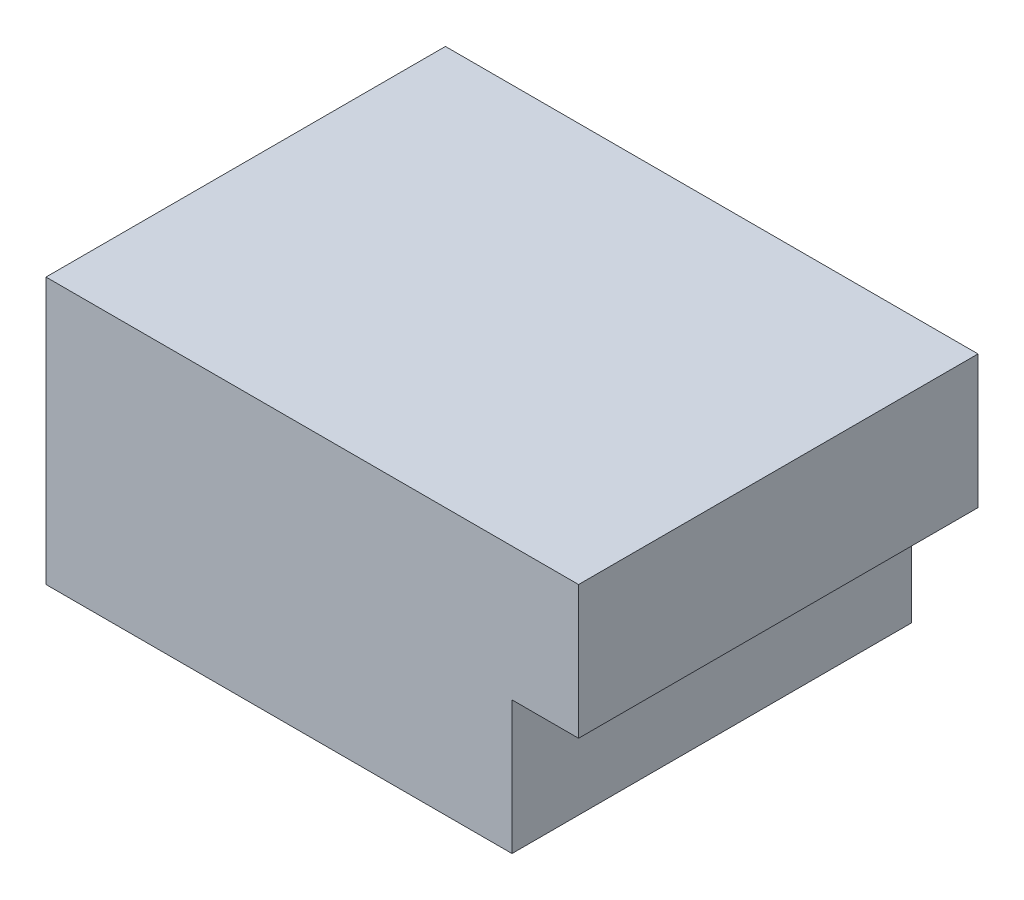
ISO-10303-21;
HEADER;
FILE_DESCRIPTION(('STEP AP214'),'2;1');
FILE_NAME('part.step','',(''),(''),'','','');
FILE_SCHEMA(('AUTOMOTIVE_DESIGN { 1 0 10303 214 1 1 1 1 }'));
ENDSEC;
DATA;
#1=APPLICATION_CONTEXT('core data for automotive mechanical design processes');
#2=APPLICATION_PROTOCOL_DEFINITION('international standard','automotive_design',2000,#1);
#3=PRODUCT_CONTEXT('',#1,'mechanical');
#4=PRODUCT('Part','Part','',(#3));
#5=PRODUCT_RELATED_PRODUCT_CATEGORY('part','',(#4));
#6=PRODUCT_DEFINITION_FORMATION('','',#4);
#7=PRODUCT_DEFINITION_CONTEXT('part definition',#1,'design');
#8=PRODUCT_DEFINITION('design','',#6,#7);
#9=PRODUCT_DEFINITION_SHAPE('','',#8);
#10=(LENGTH_UNIT() NAMED_UNIT(*) SI_UNIT(.MILLI.,.METRE.));
#11=(NAMED_UNIT(*) PLANE_ANGLE_UNIT() SI_UNIT($,.RADIAN.));
#12=(NAMED_UNIT(*) SI_UNIT($,.STERADIAN.) SOLID_ANGLE_UNIT());
#13=UNCERTAINTY_MEASURE_WITH_UNIT(LENGTH_MEASURE(1.E-05),#10,'distance_accuracy_value','');
#14=(GEOMETRIC_REPRESENTATION_CONTEXT(3) GLOBAL_UNCERTAINTY_ASSIGNED_CONTEXT((#13)) GLOBAL_UNIT_ASSIGNED_CONTEXT((#10,
#11,#12)) REPRESENTATION_CONTEXT('',''));
#15=CARTESIAN_POINT('',(0.,0.,0.));
#16=DIRECTION('',(0.,0.,1.));
#17=DIRECTION('',(1.,0.,0.));
#18=AXIS2_PLACEMENT_3D('',#15,#16,#17);
#19=CARTESIAN_POINT('',(0.,0.,0.));
#20=DIRECTION('',(0.,1.,0.));
#21=DIRECTION('',(1.,0.,0.));
#22=AXIS2_PLACEMENT_3D('',#19,#20,#21);
#23=PLANE('',#22);
#24=DIRECTION('',(1.,0.,0.));
#25=VECTOR('',#24,1.);
#26=CARTESIAN_POINT('',(1.6,0.,-1.35));
#27=LINE('',#26,#25);
#28=CARTESIAN_POINT('',(1.6,0.,-1.35));
#29=VERTEX_POINT('',#28);
#30=CARTESIAN_POINT('',(1.95,0.,-1.35));
#31=VERTEX_POINT('',#30);
#32=EDGE_CURVE('E11',#29,#31,#27,.T.);
#33=ORIENTED_EDGE('',*,*,#32,.T.);
#34=DIRECTION('',(0.,0.,-1.));
#35=VECTOR('',#34,1.);
#36=CARTESIAN_POINT('',(1.95,0.,-1.05));
#37=LINE('',#36,#35);
#38=CARTESIAN_POINT('',(1.95,0.,-1.05));
#39=VERTEX_POINT('',#38);
#40=EDGE_CURVE('E115',#39,#31,#37,.T.);
#41=ORIENTED_EDGE('',*,*,#40,.F.);
#42=DIRECTION('',(-1.,0.,0.));
#43=VECTOR('',#42,1.);
#44=CARTESIAN_POINT('',(1.95,0.,-1.05));
#45=LINE('',#44,#43);
#46=CARTESIAN_POINT('',(1.6,0.,-1.05));
#47=VERTEX_POINT('',#46);
#48=EDGE_CURVE('E78',#39,#47,#45,.T.);
#49=ORIENTED_EDGE('',*,*,#48,.T.);
#50=DIRECTION('',(0.,0.,1.));
#51=VECTOR('',#50,1.);
#52=CARTESIAN_POINT('',(1.6,0.,-1.35));
#53=LINE('',#52,#51);
#54=EDGE_CURVE('E106',#29,#47,#53,.T.);
#55=ORIENTED_EDGE('',*,*,#54,.F.);
#56=EDGE_LOOP('',(#33,#41,#49,#55));
#57=FACE_BOUND('',#56,.T.);
#58=ADVANCED_FACE('F17',(#57),#23,.F.);
#59=CARTESIAN_POINT('',(1.6,0.,-1.35));
#60=DIRECTION('',(-1.,0.,0.));
#61=DIRECTION('',(0.,0.,1.));
#62=AXIS2_PLACEMENT_3D('',#59,#60,#61);
#63=PLANE('',#62);
#64=DIRECTION('',(0.,1.,0.));
#65=VECTOR('',#64,1.);
#66=CARTESIAN_POINT('',(1.6,0.,-1.05));
#67=LINE('',#66,#65);
#68=CARTESIAN_POINT('',(1.6,0.2,-1.05));
#69=VERTEX_POINT('',#68);
#70=EDGE_CURVE('E24',#47,#69,#67,.T.);
#71=ORIENTED_EDGE('',*,*,#70,.T.);
#72=DIRECTION('',(0.,0.,-1.));
#73=VECTOR('',#72,1.);
#74=CARTESIAN_POINT('',(1.6,0.2,-1.05));
#75=LINE('',#74,#73);
#76=CARTESIAN_POINT('',(1.6,0.2,-1.35));
#77=VERTEX_POINT('',#76);
#78=EDGE_CURVE('E91',#69,#77,#75,.T.);
#79=ORIENTED_EDGE('',*,*,#78,.T.);
#80=DIRECTION('',(0.,1.,0.));
#81=VECTOR('',#80,1.);
#82=CARTESIAN_POINT('',(1.6,0.,-1.35));
#83=LINE('',#82,#81);
#84=EDGE_CURVE('E108',#29,#77,#83,.T.);
#85=ORIENTED_EDGE('',*,*,#84,.F.);
#86=ORIENTED_EDGE('',*,*,#54,.T.);
#87=EDGE_LOOP('',(#71,#79,#85,#86));
#88=FACE_BOUND('',#87,.T.);
#89=ADVANCED_FACE('F122',(#88),#63,.T.);
#90=CARTESIAN_POINT('',(2.,0.,-1.35));
#91=DIRECTION('',(0.,0.,-1.));
#92=DIRECTION('',(-1.,0.,0.));
#93=AXIS2_PLACEMENT_3D('',#90,#91,#92);
#94=PLANE('',#93);
#95=DIRECTION('',(0.,1.,0.));
#96=VECTOR('',#95,1.);
#97=CARTESIAN_POINT('',(2.,0.1,-1.35));
#98=LINE('',#97,#96);
#99=CARTESIAN_POINT('',(2.,0.1,-1.35));
#100=VERTEX_POINT('',#99);
#101=CARTESIAN_POINT('',(2.,0.2,-1.35));
#102=VERTEX_POINT('',#101);
#103=EDGE_CURVE('E73',#100,#102,#98,.T.);
#104=ORIENTED_EDGE('',*,*,#103,.F.);
#105=DIRECTION('',(-1.,0.,0.));
#106=VECTOR('',#105,1.);
#107=CARTESIAN_POINT('',(2.,0.1,-1.35));
#108=LINE('',#107,#106);
#109=CARTESIAN_POINT('',(1.95,0.1,-1.35));
#110=VERTEX_POINT('',#109);
#111=EDGE_CURVE('E79',#100,#110,#108,.T.);
#112=ORIENTED_EDGE('',*,*,#111,.T.);
#113=DIRECTION('',(0.,1.,0.));
#114=VECTOR('',#113,1.);
#115=CARTESIAN_POINT('',(1.95,0.,-1.35));
#116=LINE('',#115,#114);
#117=EDGE_CURVE('E99',#31,#110,#116,.T.);
#118=ORIENTED_EDGE('',*,*,#117,.F.);
#119=ORIENTED_EDGE('',*,*,#32,.F.);
#120=ORIENTED_EDGE('',*,*,#84,.T.);
#121=DIRECTION('',(1.,0.,0.));
#122=VECTOR('',#121,1.);
#123=CARTESIAN_POINT('',(1.6,0.2,-1.35));
#124=LINE('',#123,#122);
#125=EDGE_CURVE('E102',#77,#102,#124,.T.);
#126=ORIENTED_EDGE('',*,*,#125,.T.);
#127=EDGE_LOOP('',(#104,#112,#118,#119,#120,#126));
#128=FACE_BOUND('',#127,.T.);
#129=ADVANCED_FACE('F124',(#128),#94,.T.);
#130=CARTESIAN_POINT('',(0.,0.2,0.));
#131=DIRECTION('',(0.,1.,0.));
#132=DIRECTION('',(1.,0.,0.));
#133=AXIS2_PLACEMENT_3D('',#130,#131,#132);
#134=PLANE('',#133);
#135=DIRECTION('',(0.,0.,-1.));
#136=VECTOR('',#135,1.);
#137=CARTESIAN_POINT('',(2.,0.2,-1.05));
#138=LINE('',#137,#136);
#139=CARTESIAN_POINT('',(2.,0.2,-1.05));
#140=VERTEX_POINT('',#139);
#141=EDGE_CURVE('E68',#140,#102,#138,.T.);
#142=ORIENTED_EDGE('',*,*,#141,.T.);
#143=ORIENTED_EDGE('',*,*,#125,.F.);
#144=ORIENTED_EDGE('',*,*,#78,.F.);
#145=DIRECTION('',(-1.,0.,0.));
#146=VECTOR('',#145,1.);
#147=CARTESIAN_POINT('',(2.,0.2,-1.05));
#148=LINE('',#147,#146);
#149=EDGE_CURVE('E84',#140,#69,#148,.T.);
#150=ORIENTED_EDGE('',*,*,#149,.F.);
#151=EDGE_LOOP('',(#142,#143,#144,#150));
#152=FACE_BOUND('',#151,.T.);
#153=ADVANCED_FACE('F90',(#152),#134,.T.);
#154=CARTESIAN_POINT('',(1.75,0.,-1.05));
#155=DIRECTION('',(0.,0.,1.));
#156=DIRECTION('',(1.,0.,0.));
#157=AXIS2_PLACEMENT_3D('',#154,#155,#156);
#158=PLANE('',#157);
#159=DIRECTION('',(0.,1.,0.));
#160=VECTOR('',#159,1.);
#161=CARTESIAN_POINT('',(1.95,0.,-1.05));
#162=LINE('',#161,#160);
#163=CARTESIAN_POINT('',(1.95,0.1,-1.05));
#164=VERTEX_POINT('',#163);
#165=EDGE_CURVE('E104',#39,#164,#162,.T.);
#166=ORIENTED_EDGE('',*,*,#165,.T.);
#167=DIRECTION('',(-1.,0.,0.));
#168=VECTOR('',#167,1.);
#169=CARTESIAN_POINT('',(2.,0.1,-1.05));
#170=LINE('',#169,#168);
#171=CARTESIAN_POINT('',(2.,0.1,-1.05));
#172=VERTEX_POINT('',#171);
#173=EDGE_CURVE('E86',#172,#164,#170,.T.);
#174=ORIENTED_EDGE('',*,*,#173,.F.);
#175=DIRECTION('',(0.,1.,0.));
#176=VECTOR('',#175,1.);
#177=CARTESIAN_POINT('',(2.,0.1,-1.05));
#178=LINE('',#177,#176);
#179=EDGE_CURVE('E72',#172,#140,#178,.T.);
#180=ORIENTED_EDGE('',*,*,#179,.T.);
#181=ORIENTED_EDGE('',*,*,#149,.T.);
#182=ORIENTED_EDGE('',*,*,#70,.F.);
#183=ORIENTED_EDGE('',*,*,#48,.F.);
#184=EDGE_LOOP('',(#166,#174,#180,#181,#182,#183));
#185=FACE_BOUND('',#184,.T.);
#186=ADVANCED_FACE('F83',(#185),#158,.T.);
#187=CARTESIAN_POINT('',(2.,0.,-1.05));
#188=DIRECTION('',(1.,0.,0.));
#189=DIRECTION('',(0.,0.,-1.));
#190=AXIS2_PLACEMENT_3D('',#187,#188,#189);
#191=PLANE('',#190);
#192=ORIENTED_EDGE('',*,*,#103,.T.);
#193=ORIENTED_EDGE('',*,*,#141,.F.);
#194=ORIENTED_EDGE('',*,*,#179,.F.);
#195=DIRECTION('',(0.,0.,-1.));
#196=VECTOR('',#195,1.);
#197=CARTESIAN_POINT('',(2.,0.1,-1.05));
#198=LINE('',#197,#196);
#199=EDGE_CURVE('E88',#172,#100,#198,.T.);
#200=ORIENTED_EDGE('',*,*,#199,.T.);
#201=EDGE_LOOP('',(#192,#193,#194,#200));
#202=FACE_BOUND('',#201,.T.);
#203=ADVANCED_FACE('F70',(#202),#191,.T.);
#204=CARTESIAN_POINT('',(2.,0.1,-1.92));
#205=DIRECTION('',(0.,1.,0.));
#206=DIRECTION('',(-1.,0.,0.));
#207=AXIS2_PLACEMENT_3D('',#204,#205,#206);
#208=PLANE('',#207);
#209=ORIENTED_EDGE('',*,*,#199,.F.);
#210=ORIENTED_EDGE('',*,*,#173,.T.);
#211=DIRECTION('',(0.,0.,1.));
#212=VECTOR('',#211,1.);
#213=CARTESIAN_POINT('',(1.95,0.1,-1.35));
#214=LINE('',#213,#212);
#215=EDGE_CURVE('E92',#110,#164,#214,.T.);
#216=ORIENTED_EDGE('',*,*,#215,.F.);
#217=ORIENTED_EDGE('',*,*,#111,.F.);
#218=EDGE_LOOP('',(#209,#210,#216,#217));
#219=FACE_BOUND('',#218,.T.);
#220=ADVANCED_FACE('F127',(#219),#208,.F.);
#221=CARTESIAN_POINT('',(1.95,0.1,-1.92));
#222=DIRECTION('',(-1.,0.,0.));
#223=DIRECTION('',(0.,-1.,0.));
#224=AXIS2_PLACEMENT_3D('',#221,#222,#223);
#225=PLANE('',#224);
#226=ORIENTED_EDGE('',*,*,#117,.T.);
#227=ORIENTED_EDGE('',*,*,#215,.T.);
#228=ORIENTED_EDGE('',*,*,#165,.F.);
#229=ORIENTED_EDGE('',*,*,#40,.T.);
#230=EDGE_LOOP('',(#226,#227,#228,#229));
#231=FACE_BOUND('',#230,.T.);
#232=ADVANCED_FACE('F119',(#231),#225,.F.);
#233=CLOSED_SHELL('',(#58,#89,#129,#153,#186,#203,#220,#232));
#234=MANIFOLD_SOLID_BREP('B1',#233);
#235=ADVANCED_BREP_SHAPE_REPRESENTATION('',(#18,#234),#14);
#236=SHAPE_DEFINITION_REPRESENTATION(#9,#235);
ENDSEC;
END-ISO-10303-21;
